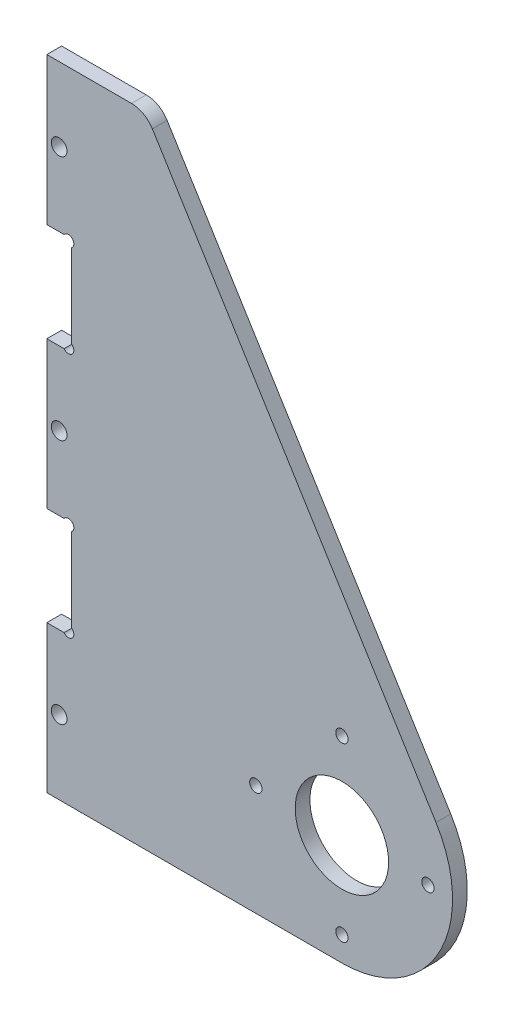
ISO-10303-21;
HEADER;
FILE_DESCRIPTION(('STEP AP214'),'2;1');
FILE_NAME('part.step','',(''),(''),'','','');
FILE_SCHEMA(('AUTOMOTIVE_DESIGN { 1 0 10303 214 1 1 1 1 }'));
ENDSEC;
DATA;
#1=APPLICATION_CONTEXT('core data for automotive mechanical design processes');
#2=APPLICATION_PROTOCOL_DEFINITION('international standard','automotive_design',2000,#1);
#3=PRODUCT_CONTEXT('',#1,'mechanical');
#4=PRODUCT('Part','Part','',(#3));
#5=PRODUCT_RELATED_PRODUCT_CATEGORY('part','',(#4));
#6=PRODUCT_DEFINITION_FORMATION('','',#4);
#7=PRODUCT_DEFINITION_CONTEXT('part definition',#1,'design');
#8=PRODUCT_DEFINITION('design','',#6,#7);
#9=PRODUCT_DEFINITION_SHAPE('','',#8);
#10=(LENGTH_UNIT() NAMED_UNIT(*) SI_UNIT(.MILLI.,.METRE.));
#11=(NAMED_UNIT(*) PLANE_ANGLE_UNIT() SI_UNIT($,.RADIAN.));
#12=(NAMED_UNIT(*) SI_UNIT($,.STERADIAN.) SOLID_ANGLE_UNIT());
#13=UNCERTAINTY_MEASURE_WITH_UNIT(LENGTH_MEASURE(1.E-05),#10,'distance_accuracy_value','');
#14=(GEOMETRIC_REPRESENTATION_CONTEXT(3) GLOBAL_UNCERTAINTY_ASSIGNED_CONTEXT((#13)) GLOBAL_UNIT_ASSIGNED_CONTEXT((#10,
#11,#12)) REPRESENTATION_CONTEXT('',''));
#15=CARTESIAN_POINT('',(0.,0.,0.));
#16=DIRECTION('',(0.,0.,1.));
#17=DIRECTION('',(1.,0.,0.));
#18=AXIS2_PLACEMENT_3D('',#15,#16,#17);
#19=CARTESIAN_POINT('',(-60.,107.5,3.));
#20=DIRECTION('',(1.,0.,0.));
#21=DIRECTION('',(0.,1.,0.));
#22=AXIS2_PLACEMENT_3D('',#19,#20,#21);
#23=PLANE('',#22);
#24=DIRECTION('',(0.,0.,-1.));
#25=VECTOR('',#24,1.);
#26=CARTESIAN_POINT('',(-60.,27.55,3.));
#27=LINE('',#26,#25);
#28=CARTESIAN_POINT('',(-60.,27.55,3.));
#29=VERTEX_POINT('',#28);
#30=CARTESIAN_POINT('',(-60.,27.55,0.));
#31=VERTEX_POINT('',#30);
#32=EDGE_CURVE('E395',#29,#31,#27,.T.);
#33=ORIENTED_EDGE('',*,*,#32,.F.);
#34=DIRECTION('',(0.,-1.,0.));
#35=VECTOR('',#34,1.);
#36=CARTESIAN_POINT('',(-60.,107.5,3.));
#37=LINE('',#36,#35);
#38=CARTESIAN_POINT('',(-60.,57.45,3.));
#39=VERTEX_POINT('',#38);
#40=EDGE_CURVE('E350',#39,#29,#37,.T.);
#41=ORIENTED_EDGE('',*,*,#40,.F.);
#42=DIRECTION('',(0.,0.,-1.));
#43=VECTOR('',#42,1.);
#44=CARTESIAN_POINT('',(-60.,57.45,3.));
#45=LINE('',#44,#43);
#46=CARTESIAN_POINT('',(-60.,57.45,0.));
#47=VERTEX_POINT('',#46);
#48=EDGE_CURVE('E392',#39,#47,#45,.T.);
#49=ORIENTED_EDGE('',*,*,#48,.T.);
#50=DIRECTION('',(0.,-1.,0.));
#51=VECTOR('',#50,1.);
#52=CARTESIAN_POINT('',(-60.,107.5,0.));
#53=LINE('',#52,#51);
#54=EDGE_CURVE('E364',#47,#31,#53,.T.);
#55=ORIENTED_EDGE('',*,*,#54,.T.);
#56=EDGE_LOOP('',(#33,#41,#49,#55));
#57=FACE_BOUND('',#56,.T.);
#58=ADVANCED_FACE('F111',(#57),#23,.F.);
#59=DIRECTION('',(0.,0.,-1.));
#60=VECTOR('',#59,1.);
#61=CARTESIAN_POINT('',(-60.,77.55,3.));
#62=LINE('',#61,#60);
#63=CARTESIAN_POINT('',(-60.,77.55,3.));
#64=VERTEX_POINT('',#63);
#65=CARTESIAN_POINT('',(-60.,77.55,0.));
#66=VERTEX_POINT('',#65);
#67=EDGE_CURVE('E390',#64,#66,#62,.T.);
#68=ORIENTED_EDGE('',*,*,#67,.F.);
#69=CARTESIAN_POINT('',(-60.,107.5,3.));
#70=VERTEX_POINT('',#69);
#71=EDGE_CURVE('E346',#70,#64,#37,.T.);
#72=ORIENTED_EDGE('',*,*,#71,.F.);
#73=DIRECTION('',(0.,0.,-1.));
#74=VECTOR('',#73,1.);
#75=CARTESIAN_POINT('',(-60.,107.5,3.));
#76=LINE('',#75,#74);
#77=CARTESIAN_POINT('',(-60.,107.5,0.));
#78=VERTEX_POINT('',#77);
#79=EDGE_CURVE('E378',#70,#78,#76,.T.);
#80=ORIENTED_EDGE('',*,*,#79,.T.);
#81=EDGE_CURVE('E360',#78,#66,#53,.T.);
#82=ORIENTED_EDGE('',*,*,#81,.T.);
#83=EDGE_LOOP('',(#68,#72,#80,#82));
#84=FACE_BOUND('',#83,.T.);
#85=ADVANCED_FACE('F454',(#84),#23,.F.);
#86=CARTESIAN_POINT('',(0.,0.,3.));
#87=DIRECTION('',(0.,0.,1.));
#88=DIRECTION('',(1.,0.,0.));
#89=AXIS2_PLACEMENT_3D('',#86,#87,#88);
#90=PLANE('',#89);
#91=CARTESIAN_POINT('',(-57.5000000000003,92.5,3.));
#92=DIRECTION('',(0.,0.,1.));
#93=DIRECTION('',(1.,0.,0.));
#94=AXIS2_PLACEMENT_3D('',#91,#92,#93);
#95=CIRCLE('',#94,1.6);
#96=CARTESIAN_POINT('',(-55.9000000000003,92.5,3.));
#97=VERTEX_POINT('',#96);
#98=EDGE_CURVE('E261',#97,#97,#95,.T.);
#99=ORIENTED_EDGE('',*,*,#98,.F.);
#100=EDGE_LOOP('',(#99));
#101=FACE_BOUND('',#100,.T.);
#102=DIRECTION('',(1.,0.,0.));
#103=VECTOR('',#102,1.);
#104=CARTESIAN_POINT('',(-60.,7.45,3.));
#105=LINE('',#104,#103);
#106=CARTESIAN_POINT('',(-60.,7.45,3.));
#107=VERTEX_POINT('',#106);
#108=CARTESIAN_POINT('',(-56.49,7.45,3.));
#109=VERTEX_POINT('',#108);
#110=EDGE_CURVE('E249',#107,#109,#105,.T.);
#111=ORIENTED_EDGE('',*,*,#110,.F.);
#112=CARTESIAN_POINT('',(-60.,-22.5,3.));
#113=VERTEX_POINT('',#112);
#114=EDGE_CURVE('E344',#107,#113,#37,.T.);
#115=ORIENTED_EDGE('',*,*,#114,.T.);
#116=DIRECTION('',(1.,0.,0.));
#117=VECTOR('',#116,1.);
#118=CARTESIAN_POINT('',(-60.,-22.5,3.));
#119=LINE('',#118,#117);
#120=CARTESIAN_POINT('',(0.,-22.5,3.));
#121=VERTEX_POINT('',#120);
#122=EDGE_CURVE('E349',#113,#121,#119,.T.);
#123=ORIENTED_EDGE('',*,*,#122,.T.);
#124=CARTESIAN_POINT('',(0.,0.,3.));
#125=DIRECTION('',(0.,0.,1.));
#126=DIRECTION('',(1.,0.,0.));
#127=AXIS2_PLACEMENT_3D('',#124,#125,#126);
#128=CIRCLE('',#127,22.5);
#129=CARTESIAN_POINT('',(19.1385979441861,11.8306410955111,3.));
#130=VERTEX_POINT('',#129);
#131=EDGE_CURVE('E352',#121,#130,#128,.T.);
#132=ORIENTED_EDGE('',*,*,#131,.T.);
#133=DIRECTION('',(-0.525806270911604,0.850604353074937,0.));
#134=VECTOR('',#133,1.);
#135=CARTESIAN_POINT('',(-40.,107.5,3.));
#136=LINE('',#135,#134);
#137=CARTESIAN_POINT('',(-38.5343712650876,105.129031354558,3.));
#138=VERTEX_POINT('',#137);
#139=EDGE_CURVE('E354',#130,#138,#136,.T.);
#140=ORIENTED_EDGE('',*,*,#139,.T.);
#141=CARTESIAN_POINT('',(-42.7873930304623,102.5,3.));
#142=DIRECTION('',(0.,0.,1.));
#143=DIRECTION('',(1.,0.,0.));
#144=AXIS2_PLACEMENT_3D('',#141,#142,#143);
#145=CIRCLE('',#144,5.);
#146=CARTESIAN_POINT('',(-42.7873930304623,107.5,3.));
#147=VERTEX_POINT('',#146);
#148=EDGE_CURVE('E388',#138,#147,#145,.T.);
#149=ORIENTED_EDGE('',*,*,#148,.T.);
#150=DIRECTION('',(-1.,0.,0.));
#151=VECTOR('',#150,1.);
#152=CARTESIAN_POINT('',(-60.,107.5,3.));
#153=LINE('',#152,#151);
#154=EDGE_CURVE('E342',#147,#70,#153,.T.);
#155=ORIENTED_EDGE('',*,*,#154,.T.);
#156=ORIENTED_EDGE('',*,*,#71,.T.);
#157=DIRECTION('',(1.,0.,0.));
#158=VECTOR('',#157,1.);
#159=CARTESIAN_POINT('',(0.,77.55,3.));
#160=LINE('',#159,#158);
#161=CARTESIAN_POINT('',(-56.4900000000002,77.55,3.));
#162=VERTEX_POINT('',#161);
#163=EDGE_CURVE('E135',#64,#162,#160,.T.);
#164=ORIENTED_EDGE('',*,*,#163,.T.);
#165=CARTESIAN_POINT('',(-55.6100000000002,76.89,3.));
#166=DIRECTION('',(0.,0.,1.));
#167=DIRECTION('',(1.,0.,0.));
#168=AXIS2_PLACEMENT_3D('',#165,#166,#167);
#169=CIRCLE('',#168,1.10000000000001);
#170=CARTESIAN_POINT('',(-54.95,76.0100000000001,3.));
#171=VERTEX_POINT('',#170);
#172=EDGE_CURVE('E284',#171,#162,#169,.T.);
#173=ORIENTED_EDGE('',*,*,#172,.F.);
#174=DIRECTION('',(0.,-1.,0.));
#175=VECTOR('',#174,1.);
#176=CARTESIAN_POINT('',(-54.95,0.,3.));
#177=LINE('',#176,#175);
#178=CARTESIAN_POINT('',(-54.95,58.99,3.));
#179=VERTEX_POINT('',#178);
#180=EDGE_CURVE('E289',#171,#179,#177,.T.);
#181=ORIENTED_EDGE('',*,*,#180,.T.);
#182=CARTESIAN_POINT('',(-55.61,58.11,3.));
#183=DIRECTION('',(0.,0.,1.));
#184=DIRECTION('',(1.,0.,0.));
#185=AXIS2_PLACEMENT_3D('',#182,#183,#184);
#186=CIRCLE('',#185,1.10000000000001);
#187=CARTESIAN_POINT('',(-56.49,57.45,3.));
#188=VERTEX_POINT('',#187);
#189=EDGE_CURVE('E281',#188,#179,#186,.T.);
#190=ORIENTED_EDGE('',*,*,#189,.F.);
#191=DIRECTION('',(1.,0.,0.));
#192=VECTOR('',#191,1.);
#193=CARTESIAN_POINT('',(0.,57.45,3.));
#194=LINE('',#193,#192);
#195=EDGE_CURVE('E298',#39,#188,#194,.T.);
#196=ORIENTED_EDGE('',*,*,#195,.F.);
#197=ORIENTED_EDGE('',*,*,#40,.T.);
#198=DIRECTION('',(1.,0.,0.));
#199=VECTOR('',#198,1.);
#200=CARTESIAN_POINT('',(-60.,27.55,3.));
#201=LINE('',#200,#199);
#202=CARTESIAN_POINT('',(-56.49,27.55,3.));
#203=VERTEX_POINT('',#202);
#204=EDGE_CURVE('E127',#29,#203,#201,.T.);
#205=ORIENTED_EDGE('',*,*,#204,.T.);
#206=CARTESIAN_POINT('',(-55.61,26.89,3.));
#207=DIRECTION('',(0.,0.,1.));
#208=DIRECTION('',(1.,0.,0.));
#209=AXIS2_PLACEMENT_3D('',#206,#207,#208);
#210=CIRCLE('',#209,1.1);
#211=CARTESIAN_POINT('',(-54.95,26.01,3.));
#212=VERTEX_POINT('',#211);
#213=EDGE_CURVE('E270',#212,#203,#210,.T.);
#214=ORIENTED_EDGE('',*,*,#213,.F.);
#215=DIRECTION('',(0.,-1.,0.));
#216=VECTOR('',#215,1.);
#217=CARTESIAN_POINT('',(-54.95,27.55,3.));
#218=LINE('',#217,#216);
#219=CARTESIAN_POINT('',(-54.95,8.99,3.));
#220=VERTEX_POINT('',#219);
#221=EDGE_CURVE('E255',#212,#220,#218,.T.);
#222=ORIENTED_EDGE('',*,*,#221,.T.);
#223=CARTESIAN_POINT('',(-55.61,8.11,3.));
#224=DIRECTION('',(0.,0.,1.));
#225=DIRECTION('',(1.,0.,0.));
#226=AXIS2_PLACEMENT_3D('',#223,#224,#225);
#227=CIRCLE('',#226,1.1);
#228=EDGE_CURVE('E242',#109,#220,#227,.T.);
#229=ORIENTED_EDGE('',*,*,#228,.F.);
#230=EDGE_LOOP('',(#111,#115,#123,#132,#140,#149,#155,#156,#164,#173,#181,#190,#196,#197,#205,
#214,#222,#229));
#231=FACE_BOUND('',#230,.T.);
#232=CARTESIAN_POINT('',(-57.5,-7.50000000000001,3.));
#233=DIRECTION('',(0.,0.,1.));
#234=DIRECTION('',(1.,0.,0.));
#235=AXIS2_PLACEMENT_3D('',#232,#233,#234);
#236=CIRCLE('',#235,1.6);
#237=CARTESIAN_POINT('',(-55.9,-7.50000000000001,3.));
#238=VERTEX_POINT('',#237);
#239=EDGE_CURVE('E274',#238,#238,#236,.T.);
#240=ORIENTED_EDGE('',*,*,#239,.F.);
#241=EDGE_LOOP('',(#240));
#242=FACE_BOUND('',#241,.T.);
#243=CARTESIAN_POINT('',(-57.5000000000002,42.5,3.));
#244=DIRECTION('',(0.,0.,1.));
#245=DIRECTION('',(1.,0.,0.));
#246=AXIS2_PLACEMENT_3D('',#243,#244,#245);
#247=CIRCLE('',#246,1.6);
#248=CARTESIAN_POINT('',(-55.9000000000002,42.5,3.));
#249=VERTEX_POINT('',#248);
#250=EDGE_CURVE('E278',#249,#249,#247,.T.);
#251=ORIENTED_EDGE('',*,*,#250,.F.);
#252=EDGE_LOOP('',(#251));
#253=FACE_BOUND('',#252,.T.);
#254=CARTESIAN_POINT('',(0.,-17.5,3.));
#255=DIRECTION('',(0.,0.,1.));
#256=DIRECTION('',(1.,0.,0.));
#257=AXIS2_PLACEMENT_3D('',#254,#255,#256);
#258=CIRCLE('',#257,1.25);
#259=CARTESIAN_POINT('',(1.24999999999994,-17.5,3.));
#260=VERTEX_POINT('',#259);
#261=EDGE_CURVE('E318',#260,#260,#258,.T.);
#262=ORIENTED_EDGE('',*,*,#261,.F.);
#263=EDGE_LOOP('',(#262));
#264=FACE_BOUND('',#263,.T.);
#265=CARTESIAN_POINT('',(0.,17.5,3.));
#266=DIRECTION('',(0.,0.,1.));
#267=DIRECTION('',(1.,0.,0.));
#268=AXIS2_PLACEMENT_3D('',#265,#266,#267);
#269=CIRCLE('',#268,1.25);
#270=CARTESIAN_POINT('',(1.25000000000005,17.5,3.));
#271=VERTEX_POINT('',#270);
#272=EDGE_CURVE('E330',#271,#271,#269,.T.);
#273=ORIENTED_EDGE('',*,*,#272,.F.);
#274=EDGE_LOOP('',(#273));
#275=FACE_BOUND('',#274,.T.);
#276=CARTESIAN_POINT('',(0.,0.,3.));
#277=DIRECTION('',(0.,0.,1.));
#278=DIRECTION('',(1.,0.,0.));
#279=AXIS2_PLACEMENT_3D('',#276,#277,#278);
#280=CIRCLE('',#279,9.5);
#281=CARTESIAN_POINT('',(9.5,0.,3.));
#282=VERTEX_POINT('',#281);
#283=EDGE_CURVE('E336',#282,#282,#280,.T.);
#284=ORIENTED_EDGE('',*,*,#283,.F.);
#285=EDGE_LOOP('',(#284));
#286=FACE_BOUND('',#285,.T.);
#287=CARTESIAN_POINT('',(17.5,0.,3.));
#288=DIRECTION('',(0.,0.,1.));
#289=DIRECTION('',(1.,0.,0.));
#290=AXIS2_PLACEMENT_3D('',#287,#288,#289);
#291=CIRCLE('',#290,1.25);
#292=CARTESIAN_POINT('',(18.75,0.,3.));
#293=VERTEX_POINT('',#292);
#294=EDGE_CURVE('E324',#293,#293,#291,.T.);
#295=ORIENTED_EDGE('',*,*,#294,.F.);
#296=EDGE_LOOP('',(#295));
#297=FACE_BOUND('',#296,.T.);
#298=CARTESIAN_POINT('',(-17.5,0.,3.));
#299=DIRECTION('',(0.,0.,1.));
#300=DIRECTION('',(1.,0.,0.));
#301=AXIS2_PLACEMENT_3D('',#298,#299,#300);
#302=CIRCLE('',#301,1.25);
#303=CARTESIAN_POINT('',(-16.25,0.,3.));
#304=VERTEX_POINT('',#303);
#305=EDGE_CURVE('E311',#304,#304,#302,.T.);
#306=ORIENTED_EDGE('',*,*,#305,.F.);
#307=EDGE_LOOP('',(#306));
#308=FACE_BOUND('',#307,.T.);
#309=ADVANCED_FACE('F257',(#101,#231,#242,#253,#264,#275,#286,#297,#308),#90,.T.);
#310=CARTESIAN_POINT('',(0.,0.,0.));
#311=DIRECTION('',(0.,0.,1.));
#312=DIRECTION('',(1.,0.,0.));
#313=AXIS2_PLACEMENT_3D('',#310,#311,#312);
#314=PLANE('',#313);
#315=CARTESIAN_POINT('',(-57.5000000000003,92.5,0.));
#316=DIRECTION('',(0.,0.,1.));
#317=DIRECTION('',(1.,0.,0.));
#318=AXIS2_PLACEMENT_3D('',#315,#316,#317);
#319=CIRCLE('',#318,1.6);
#320=CARTESIAN_POINT('',(-55.9000000000003,92.5,0.));
#321=VERTEX_POINT('',#320);
#322=EDGE_CURVE('E115',#321,#321,#319,.T.);
#323=ORIENTED_EDGE('',*,*,#322,.T.);
#324=EDGE_LOOP('',(#323));
#325=FACE_BOUND('',#324,.T.);
#326=CARTESIAN_POINT('',(-57.5,-7.50000000000001,0.));
#327=DIRECTION('',(0.,0.,1.));
#328=DIRECTION('',(1.,0.,0.));
#329=AXIS2_PLACEMENT_3D('',#326,#327,#328);
#330=CIRCLE('',#329,1.6);
#331=CARTESIAN_POINT('',(-55.9,-7.50000000000001,0.));
#332=VERTEX_POINT('',#331);
#333=EDGE_CURVE('E409',#332,#332,#330,.T.);
#334=ORIENTED_EDGE('',*,*,#333,.T.);
#335=EDGE_LOOP('',(#334));
#336=FACE_BOUND('',#335,.T.);
#337=CARTESIAN_POINT('',(-57.5000000000002,42.5,0.));
#338=DIRECTION('',(0.,0.,1.));
#339=DIRECTION('',(1.,0.,0.));
#340=AXIS2_PLACEMENT_3D('',#337,#338,#339);
#341=CIRCLE('',#340,1.6);
#342=CARTESIAN_POINT('',(-55.9000000000002,42.5,0.));
#343=VERTEX_POINT('',#342);
#344=EDGE_CURVE('E310',#343,#343,#341,.T.);
#345=ORIENTED_EDGE('',*,*,#344,.T.);
#346=EDGE_LOOP('',(#345));
#347=FACE_BOUND('',#346,.T.);
#348=CARTESIAN_POINT('',(-60.,7.45,0.));
#349=VERTEX_POINT('',#348);
#350=CARTESIAN_POINT('',(-60.,-22.5,0.));
#351=VERTEX_POINT('',#350);
#352=EDGE_CURVE('E359',#349,#351,#53,.T.);
#353=ORIENTED_EDGE('',*,*,#352,.F.);
#354=DIRECTION('',(1.,0.,0.));
#355=VECTOR('',#354,1.);
#356=CARTESIAN_POINT('',(0.,7.45,0.));
#357=LINE('',#356,#355);
#358=CARTESIAN_POINT('',(-56.49,7.45,0.));
#359=VERTEX_POINT('',#358);
#360=EDGE_CURVE('E308',#349,#359,#357,.T.);
#361=ORIENTED_EDGE('',*,*,#360,.T.);
#362=CARTESIAN_POINT('',(-55.61,8.11,0.));
#363=DIRECTION('',(0.,0.,1.));
#364=DIRECTION('',(1.,0.,0.));
#365=AXIS2_PLACEMENT_3D('',#362,#363,#364);
#366=CIRCLE('',#365,1.1);
#367=CARTESIAN_POINT('',(-54.95,8.99,0.));
#368=VERTEX_POINT('',#367);
#369=EDGE_CURVE('E12',#359,#368,#366,.T.);
#370=ORIENTED_EDGE('',*,*,#369,.T.);
#371=DIRECTION('',(0.,-1.,0.));
#372=VECTOR('',#371,1.);
#373=CARTESIAN_POINT('',(-54.95,0.,0.));
#374=LINE('',#373,#372);
#375=CARTESIAN_POINT('',(-54.95,26.01,0.));
#376=VERTEX_POINT('',#375);
#377=EDGE_CURVE('E120',#376,#368,#374,.T.);
#378=ORIENTED_EDGE('',*,*,#377,.F.);
#379=CARTESIAN_POINT('',(-55.61,26.89,0.));
#380=DIRECTION('',(0.,0.,1.));
#381=DIRECTION('',(1.,0.,0.));
#382=AXIS2_PLACEMENT_3D('',#379,#380,#381);
#383=CIRCLE('',#382,1.1);
#384=CARTESIAN_POINT('',(-56.49,27.55,0.));
#385=VERTEX_POINT('',#384);
#386=EDGE_CURVE('E406',#376,#385,#383,.T.);
#387=ORIENTED_EDGE('',*,*,#386,.T.);
#388=DIRECTION('',(1.,0.,0.));
#389=VECTOR('',#388,1.);
#390=CARTESIAN_POINT('',(0.,27.55,0.));
#391=LINE('',#390,#389);
#392=EDGE_CURVE('E306',#31,#385,#391,.T.);
#393=ORIENTED_EDGE('',*,*,#392,.F.);
#394=ORIENTED_EDGE('',*,*,#54,.F.);
#395=DIRECTION('',(1.,0.,0.));
#396=VECTOR('',#395,1.);
#397=CARTESIAN_POINT('',(0.,57.45,0.));
#398=LINE('',#397,#396);
#399=CARTESIAN_POINT('',(-56.49,57.45,0.));
#400=VERTEX_POINT('',#399);
#401=EDGE_CURVE('E303',#47,#400,#398,.T.);
#402=ORIENTED_EDGE('',*,*,#401,.T.);
#403=CARTESIAN_POINT('',(-55.61,58.11,0.));
#404=DIRECTION('',(0.,0.,1.));
#405=DIRECTION('',(1.,0.,0.));
#406=AXIS2_PLACEMENT_3D('',#403,#404,#405);
#407=CIRCLE('',#406,1.10000000000001);
#408=CARTESIAN_POINT('',(-54.95,58.99,0.));
#409=VERTEX_POINT('',#408);
#410=EDGE_CURVE('E403',#400,#409,#407,.T.);
#411=ORIENTED_EDGE('',*,*,#410,.T.);
#412=DIRECTION('',(0.,-1.,0.));
#413=VECTOR('',#412,1.);
#414=CARTESIAN_POINT('',(-54.95,0.,0.));
#415=LINE('',#414,#413);
#416=CARTESIAN_POINT('',(-54.95,76.0100000000001,0.));
#417=VERTEX_POINT('',#416);
#418=EDGE_CURVE('E401',#417,#409,#415,.T.);
#419=ORIENTED_EDGE('',*,*,#418,.F.);
#420=CARTESIAN_POINT('',(-55.6100000000002,76.89,0.));
#421=DIRECTION('',(0.,0.,1.));
#422=DIRECTION('',(1.,0.,0.));
#423=AXIS2_PLACEMENT_3D('',#420,#421,#422);
#424=CIRCLE('',#423,1.10000000000001);
#425=CARTESIAN_POINT('',(-56.4900000000002,77.55,0.));
#426=VERTEX_POINT('',#425);
#427=EDGE_CURVE('E398',#417,#426,#424,.T.);
#428=ORIENTED_EDGE('',*,*,#427,.T.);
#429=DIRECTION('',(1.,0.,0.));
#430=VECTOR('',#429,1.);
#431=CARTESIAN_POINT('',(0.,77.55,0.));
#432=LINE('',#431,#430);
#433=EDGE_CURVE('E264',#66,#426,#432,.T.);
#434=ORIENTED_EDGE('',*,*,#433,.F.);
#435=ORIENTED_EDGE('',*,*,#81,.F.);
#436=DIRECTION('',(-1.,0.,0.));
#437=VECTOR('',#436,1.);
#438=CARTESIAN_POINT('',(-60.,107.5,0.));
#439=LINE('',#438,#437);
#440=CARTESIAN_POINT('',(-42.7873930304623,107.5,0.));
#441=VERTEX_POINT('',#440);
#442=EDGE_CURVE('E339',#441,#78,#439,.T.);
#443=ORIENTED_EDGE('',*,*,#442,.F.);
#444=CARTESIAN_POINT('',(-42.7873930304623,102.5,0.));
#445=DIRECTION('',(0.,0.,1.));
#446=DIRECTION('',(1.,0.,0.));
#447=AXIS2_PLACEMENT_3D('',#444,#445,#446);
#448=CIRCLE('',#447,5.);
#449=CARTESIAN_POINT('',(-38.5343712650876,105.129031354558,0.));
#450=VERTEX_POINT('',#449);
#451=EDGE_CURVE('E384',#441,#450,#448,.F.);
#452=ORIENTED_EDGE('',*,*,#451,.T.);
#453=DIRECTION('',(-0.525806270911604,0.850604353074937,0.));
#454=VECTOR('',#453,1.);
#455=CARTESIAN_POINT('',(-40.,107.5,0.));
#456=LINE('',#455,#454);
#457=CARTESIAN_POINT('',(19.1385979441861,11.8306410955111,0.));
#458=VERTEX_POINT('',#457);
#459=EDGE_CURVE('E345',#458,#450,#456,.T.);
#460=ORIENTED_EDGE('',*,*,#459,.F.);
#461=CARTESIAN_POINT('',(0.,0.,0.));
#462=DIRECTION('',(0.,0.,1.));
#463=DIRECTION('',(1.,0.,0.));
#464=AXIS2_PLACEMENT_3D('',#461,#462,#463);
#465=CIRCLE('',#464,22.5);
#466=CARTESIAN_POINT('',(0.,-22.5,0.));
#467=VERTEX_POINT('',#466);
#468=EDGE_CURVE('E366',#467,#458,#465,.T.);
#469=ORIENTED_EDGE('',*,*,#468,.F.);
#470=DIRECTION('',(1.,0.,0.));
#471=VECTOR('',#470,1.);
#472=CARTESIAN_POINT('',(-40.,-22.5,0.));
#473=LINE('',#472,#471);
#474=EDGE_CURVE('E363',#351,#467,#473,.T.);
#475=ORIENTED_EDGE('',*,*,#474,.F.);
#476=EDGE_LOOP('',(#353,#361,#370,#378,#387,#393,#394,#402,#411,#419,#428,#434,#435,#443,#452,
#460,#469,#475));
#477=FACE_BOUND('',#476,.T.);
#478=CARTESIAN_POINT('',(0.,0.,0.));
#479=DIRECTION('',(0.,0.,1.));
#480=DIRECTION('',(1.,0.,0.));
#481=AXIS2_PLACEMENT_3D('',#478,#479,#480);
#482=CIRCLE('',#481,9.5);
#483=CARTESIAN_POINT('',(9.5,0.,0.));
#484=VERTEX_POINT('',#483);
#485=EDGE_CURVE('E333',#484,#484,#482,.T.);
#486=ORIENTED_EDGE('',*,*,#485,.T.);
#487=EDGE_LOOP('',(#486));
#488=FACE_BOUND('',#487,.T.);
#489=CARTESIAN_POINT('',(0.,17.5,0.));
#490=DIRECTION('',(0.,0.,1.));
#491=DIRECTION('',(1.,0.,0.));
#492=AXIS2_PLACEMENT_3D('',#489,#490,#491);
#493=CIRCLE('',#492,1.25);
#494=CARTESIAN_POINT('',(1.25000000000005,17.5,0.));
#495=VERTEX_POINT('',#494);
#496=EDGE_CURVE('E327',#495,#495,#493,.T.);
#497=ORIENTED_EDGE('',*,*,#496,.T.);
#498=EDGE_LOOP('',(#497));
#499=FACE_BOUND('',#498,.T.);
#500=CARTESIAN_POINT('',(17.5,0.,0.));
#501=DIRECTION('',(0.,0.,1.));
#502=DIRECTION('',(1.,0.,0.));
#503=AXIS2_PLACEMENT_3D('',#500,#501,#502);
#504=CIRCLE('',#503,1.25);
#505=CARTESIAN_POINT('',(18.75,0.,0.));
#506=VERTEX_POINT('',#505);
#507=EDGE_CURVE('E321',#506,#506,#504,.T.);
#508=ORIENTED_EDGE('',*,*,#507,.T.);
#509=EDGE_LOOP('',(#508));
#510=FACE_BOUND('',#509,.T.);
#511=CARTESIAN_POINT('',(0.,-17.5,0.));
#512=DIRECTION('',(0.,0.,1.));
#513=DIRECTION('',(1.,0.,0.));
#514=AXIS2_PLACEMENT_3D('',#511,#512,#513);
#515=CIRCLE('',#514,1.25);
#516=CARTESIAN_POINT('',(1.24999999999994,-17.5,0.));
#517=VERTEX_POINT('',#516);
#518=EDGE_CURVE('E314',#517,#517,#515,.T.);
#519=ORIENTED_EDGE('',*,*,#518,.T.);
#520=EDGE_LOOP('',(#519));
#521=FACE_BOUND('',#520,.T.);
#522=CARTESIAN_POINT('',(-17.5,0.,0.));
#523=DIRECTION('',(0.,0.,1.));
#524=DIRECTION('',(1.,0.,0.));
#525=AXIS2_PLACEMENT_3D('',#522,#523,#524);
#526=CIRCLE('',#525,1.25);
#527=CARTESIAN_POINT('',(-16.25,0.,0.));
#528=VERTEX_POINT('',#527);
#529=EDGE_CURVE('E315',#528,#528,#526,.T.);
#530=ORIENTED_EDGE('',*,*,#529,.T.);
#531=EDGE_LOOP('',(#530));
#532=FACE_BOUND('',#531,.T.);
#533=ADVANCED_FACE('F420',(#325,#336,#347,#477,#488,#499,#510,#521,#532),#314,.F.);
#534=CARTESIAN_POINT('',(-60.,107.5,3.));
#535=DIRECTION('',(0.,-1.,0.));
#536=DIRECTION('',(0.,0.,-1.));
#537=AXIS2_PLACEMENT_3D('',#534,#535,#536);
#538=PLANE('',#537);
#539=ORIENTED_EDGE('',*,*,#154,.F.);
#540=DIRECTION('',(0.,0.,-1.));
#541=VECTOR('',#540,1.);
#542=CARTESIAN_POINT('',(-42.7873930304623,107.5,3.));
#543=LINE('',#542,#541);
#544=EDGE_CURVE('E381',#147,#441,#543,.T.);
#545=ORIENTED_EDGE('',*,*,#544,.T.);
#546=ORIENTED_EDGE('',*,*,#442,.T.);
#547=ORIENTED_EDGE('',*,*,#79,.F.);
#548=EDGE_LOOP('',(#539,#545,#546,#547));
#549=FACE_BOUND('',#548,.T.);
#550=ADVANCED_FACE('F464',(#549),#538,.F.);
#551=ORIENTED_EDGE('',*,*,#114,.F.);
#552=DIRECTION('',(0.,0.,-1.));
#553=VECTOR('',#552,1.);
#554=CARTESIAN_POINT('',(-60.,7.45,3.));
#555=LINE('',#554,#553);
#556=EDGE_CURVE('E252',#107,#349,#555,.T.);
#557=ORIENTED_EDGE('',*,*,#556,.T.);
#558=ORIENTED_EDGE('',*,*,#352,.T.);
#559=DIRECTION('',(0.,0.,-1.));
#560=VECTOR('',#559,1.);
#561=CARTESIAN_POINT('',(-60.,-22.5,3.));
#562=LINE('',#561,#560);
#563=EDGE_CURVE('E375',#113,#351,#562,.T.);
#564=ORIENTED_EDGE('',*,*,#563,.F.);
#565=EDGE_LOOP('',(#551,#557,#558,#564));
#566=FACE_BOUND('',#565,.T.);
#567=ADVANCED_FACE('F424',(#566),#23,.F.);
#568=CARTESIAN_POINT('',(-40.,-22.5,3.));
#569=DIRECTION('',(0.,1.,0.));
#570=DIRECTION('',(-1.,0.,0.));
#571=AXIS2_PLACEMENT_3D('',#568,#569,#570);
#572=PLANE('',#571);
#573=ORIENTED_EDGE('',*,*,#474,.T.);
#574=DIRECTION('',(0.,0.,-1.));
#575=VECTOR('',#574,1.);
#576=CARTESIAN_POINT('',(0.,-22.5,3.));
#577=LINE('',#576,#575);
#578=EDGE_CURVE('E372',#121,#467,#577,.T.);
#579=ORIENTED_EDGE('',*,*,#578,.F.);
#580=ORIENTED_EDGE('',*,*,#122,.F.);
#581=ORIENTED_EDGE('',*,*,#563,.T.);
#582=EDGE_LOOP('',(#573,#579,#580,#581));
#583=FACE_BOUND('',#582,.T.);
#584=ADVANCED_FACE('F463',(#583),#572,.F.);
#585=CARTESIAN_POINT('',(0.,0.,3.));
#586=DIRECTION('',(0.,0.,-1.));
#587=DIRECTION('',(-1.,0.,0.));
#588=AXIS2_PLACEMENT_3D('',#585,#586,#587);
#589=CYLINDRICAL_SURFACE('',#588,22.5);
#590=ORIENTED_EDGE('',*,*,#468,.T.);
#591=DIRECTION('',(0.,0.,-1.));
#592=VECTOR('',#591,1.);
#593=CARTESIAN_POINT('',(19.1385979441861,11.8306410955111,3.));
#594=LINE('',#593,#592);
#595=EDGE_CURVE('E357',#130,#458,#594,.T.);
#596=ORIENTED_EDGE('',*,*,#595,.F.);
#597=ORIENTED_EDGE('',*,*,#131,.F.);
#598=ORIENTED_EDGE('',*,*,#578,.T.);
#599=EDGE_LOOP('',(#590,#596,#597,#598));
#600=FACE_BOUND('',#599,.T.);
#601=ADVANCED_FACE('F470',(#600),#589,.T.);
#602=CARTESIAN_POINT('',(-40.,107.5,3.));
#603=DIRECTION('',(-0.850604353074937,-0.525806270911604,0.));
#604=DIRECTION('',(0.525806270911604,-0.850604353074937,0.));
#605=AXIS2_PLACEMENT_3D('',#602,#603,#604);
#606=PLANE('',#605);
#607=ORIENTED_EDGE('',*,*,#459,.T.);
#608=DIRECTION('',(0.,0.,-1.));
#609=VECTOR('',#608,1.);
#610=CARTESIAN_POINT('',(-38.5343712650876,105.129031354558,3.));
#611=LINE('',#610,#609);
#612=EDGE_CURVE('E386',#450,#138,#611,.F.);
#613=ORIENTED_EDGE('',*,*,#612,.T.);
#614=ORIENTED_EDGE('',*,*,#139,.F.);
#615=ORIENTED_EDGE('',*,*,#595,.T.);
#616=EDGE_LOOP('',(#607,#613,#614,#615));
#617=FACE_BOUND('',#616,.T.);
#618=ADVANCED_FACE('F492',(#617),#606,.F.);
#619=CARTESIAN_POINT('',(0.,0.,3.));
#620=DIRECTION('',(0.,0.,-1.));
#621=DIRECTION('',(-1.,0.,0.));
#622=AXIS2_PLACEMENT_3D('',#619,#620,#621);
#623=CYLINDRICAL_SURFACE('',#622,9.5);
#624=ORIENTED_EDGE('',*,*,#283,.T.);
#625=EDGE_LOOP('',(#624));
#626=FACE_BOUND('',#625,.T.);
#627=ORIENTED_EDGE('',*,*,#485,.F.);
#628=EDGE_LOOP('',(#627));
#629=FACE_BOUND('',#628,.T.);
#630=ADVANCED_FACE('F503',(#626,#629),#623,.F.);
#631=CARTESIAN_POINT('',(0.,17.5,3.));
#632=DIRECTION('',(0.,0.,-1.));
#633=DIRECTION('',(-1.,0.,0.));
#634=AXIS2_PLACEMENT_3D('',#631,#632,#633);
#635=CYLINDRICAL_SURFACE('',#634,1.25);
#636=ORIENTED_EDGE('',*,*,#272,.T.);
#637=EDGE_LOOP('',(#636));
#638=FACE_BOUND('',#637,.T.);
#639=ORIENTED_EDGE('',*,*,#496,.F.);
#640=EDGE_LOOP('',(#639));
#641=FACE_BOUND('',#640,.T.);
#642=ADVANCED_FACE('F510',(#638,#641),#635,.F.);
#643=CARTESIAN_POINT('',(17.5,0.,3.));
#644=DIRECTION('',(0.,0.,-1.));
#645=DIRECTION('',(-1.,0.,0.));
#646=AXIS2_PLACEMENT_3D('',#643,#644,#645);
#647=CYLINDRICAL_SURFACE('',#646,1.25);
#648=ORIENTED_EDGE('',*,*,#294,.T.);
#649=EDGE_LOOP('',(#648));
#650=FACE_BOUND('',#649,.T.);
#651=ORIENTED_EDGE('',*,*,#507,.F.);
#652=EDGE_LOOP('',(#651));
#653=FACE_BOUND('',#652,.T.);
#654=ADVANCED_FACE('F514',(#650,#653),#647,.F.);
#655=CARTESIAN_POINT('',(0.,-17.5,3.));
#656=DIRECTION('',(0.,0.,-1.));
#657=DIRECTION('',(-1.,0.,0.));
#658=AXIS2_PLACEMENT_3D('',#655,#656,#657);
#659=CYLINDRICAL_SURFACE('',#658,1.25);
#660=ORIENTED_EDGE('',*,*,#261,.T.);
#661=EDGE_LOOP('',(#660));
#662=FACE_BOUND('',#661,.T.);
#663=ORIENTED_EDGE('',*,*,#518,.F.);
#664=EDGE_LOOP('',(#663));
#665=FACE_BOUND('',#664,.T.);
#666=ADVANCED_FACE('F518',(#662,#665),#659,.F.);
#667=CARTESIAN_POINT('',(-17.5,0.,3.));
#668=DIRECTION('',(0.,0.,-1.));
#669=DIRECTION('',(-1.,0.,0.));
#670=AXIS2_PLACEMENT_3D('',#667,#668,#669);
#671=CYLINDRICAL_SURFACE('',#670,1.25);
#672=ORIENTED_EDGE('',*,*,#305,.T.);
#673=EDGE_LOOP('',(#672));
#674=FACE_BOUND('',#673,.T.);
#675=ORIENTED_EDGE('',*,*,#529,.F.);
#676=EDGE_LOOP('',(#675));
#677=FACE_BOUND('',#676,.T.);
#678=ADVANCED_FACE('F522',(#674,#677),#671,.F.);
#679=CARTESIAN_POINT('',(-42.7873930304623,102.5,3.));
#680=DIRECTION('',(0.,0.,-1.));
#681=DIRECTION('',(-1.,0.,0.));
#682=AXIS2_PLACEMENT_3D('',#679,#680,#681);
#683=CYLINDRICAL_SURFACE('',#682,5.);
#684=ORIENTED_EDGE('',*,*,#148,.F.);
#685=ORIENTED_EDGE('',*,*,#612,.F.);
#686=ORIENTED_EDGE('',*,*,#451,.F.);
#687=ORIENTED_EDGE('',*,*,#544,.F.);
#688=EDGE_LOOP('',(#684,#685,#686,#687));
#689=FACE_BOUND('',#688,.T.);
#690=ADVANCED_FACE('F113',(#689),#683,.T.);
#691=CARTESIAN_POINT('',(-54.95,0.,-7.));
#692=DIRECTION('',(-1.,0.,0.));
#693=DIRECTION('',(0.,0.,1.));
#694=AXIS2_PLACEMENT_3D('',#691,#692,#693);
#695=PLANE('',#694);
#696=ORIENTED_EDGE('',*,*,#418,.T.);
#697=DIRECTION('',(0.,0.,1.));
#698=VECTOR('',#697,1.);
#699=CARTESIAN_POINT('',(-54.95,58.99,-7.));
#700=LINE('',#699,#698);
#701=EDGE_CURVE('E292',#409,#179,#700,.T.);
#702=ORIENTED_EDGE('',*,*,#701,.T.);
#703=ORIENTED_EDGE('',*,*,#180,.F.);
#704=DIRECTION('',(0.,0.,1.));
#705=VECTOR('',#704,1.);
#706=CARTESIAN_POINT('',(-54.95,76.0100000000001,-7.));
#707=LINE('',#706,#705);
#708=EDGE_CURVE('E294',#417,#171,#707,.T.);
#709=ORIENTED_EDGE('',*,*,#708,.F.);
#710=EDGE_LOOP('',(#696,#702,#703,#709));
#711=FACE_BOUND('',#710,.T.);
#712=ADVANCED_FACE('F526',(#711),#695,.T.);
#713=CARTESIAN_POINT('',(-55.61,58.11,-7.));
#714=DIRECTION('',(0.,0.,1.));
#715=DIRECTION('',(1.,0.,0.));
#716=AXIS2_PLACEMENT_3D('',#713,#714,#715);
#717=CYLINDRICAL_SURFACE('',#716,1.10000000000001);
#718=DIRECTION('',(0.,0.,1.));
#719=VECTOR('',#718,1.);
#720=CARTESIAN_POINT('',(-56.49,57.45,-7.));
#721=LINE('',#720,#719);
#722=EDGE_CURVE('E290',#400,#188,#721,.T.);
#723=ORIENTED_EDGE('',*,*,#722,.T.);
#724=ORIENTED_EDGE('',*,*,#189,.T.);
#725=ORIENTED_EDGE('',*,*,#701,.F.);
#726=ORIENTED_EDGE('',*,*,#410,.F.);
#727=EDGE_LOOP('',(#723,#724,#725,#726));
#728=FACE_BOUND('',#727,.T.);
#729=ADVANCED_FACE('F528',(#728),#717,.F.);
#730=CARTESIAN_POINT('',(-55.6100000000002,76.89,-7.));
#731=DIRECTION('',(0.,0.,1.));
#732=DIRECTION('',(1.,0.,0.));
#733=AXIS2_PLACEMENT_3D('',#730,#731,#732);
#734=CYLINDRICAL_SURFACE('',#733,1.10000000000001);
#735=ORIENTED_EDGE('',*,*,#708,.T.);
#736=ORIENTED_EDGE('',*,*,#172,.T.);
#737=DIRECTION('',(0.,0.,1.));
#738=VECTOR('',#737,1.);
#739=CARTESIAN_POINT('',(-56.4900000000002,77.55,-7.));
#740=LINE('',#739,#738);
#741=EDGE_CURVE('E287',#426,#162,#740,.T.);
#742=ORIENTED_EDGE('',*,*,#741,.F.);
#743=ORIENTED_EDGE('',*,*,#427,.F.);
#744=EDGE_LOOP('',(#735,#736,#742,#743));
#745=FACE_BOUND('',#744,.T.);
#746=ADVANCED_FACE('F531',(#745),#734,.F.);
#747=CARTESIAN_POINT('',(0.,57.45,-7.));
#748=DIRECTION('',(0.,-1.,0.));
#749=DIRECTION('',(0.,0.,-1.));
#750=AXIS2_PLACEMENT_3D('',#747,#748,#749);
#751=PLANE('',#750);
#752=ORIENTED_EDGE('',*,*,#48,.F.);
#753=ORIENTED_EDGE('',*,*,#195,.T.);
#754=ORIENTED_EDGE('',*,*,#722,.F.);
#755=ORIENTED_EDGE('',*,*,#401,.F.);
#756=EDGE_LOOP('',(#752,#753,#754,#755));
#757=FACE_BOUND('',#756,.T.);
#758=ADVANCED_FACE('F449',(#757),#751,.F.);
#759=CARTESIAN_POINT('',(0.,77.55,-7.));
#760=DIRECTION('',(0.,-1.,0.));
#761=DIRECTION('',(0.,0.,-1.));
#762=AXIS2_PLACEMENT_3D('',#759,#760,#761);
#763=PLANE('',#762);
#764=ORIENTED_EDGE('',*,*,#433,.T.);
#765=ORIENTED_EDGE('',*,*,#741,.T.);
#766=ORIENTED_EDGE('',*,*,#163,.F.);
#767=ORIENTED_EDGE('',*,*,#67,.T.);
#768=EDGE_LOOP('',(#764,#765,#766,#767));
#769=FACE_BOUND('',#768,.T.);
#770=ADVANCED_FACE('F442',(#769),#763,.T.);
#771=CARTESIAN_POINT('',(-55.61,26.89,-7.));
#772=DIRECTION('',(0.,0.,1.));
#773=DIRECTION('',(1.,0.,0.));
#774=AXIS2_PLACEMENT_3D('',#771,#772,#773);
#775=CYLINDRICAL_SURFACE('',#774,1.1);
#776=DIRECTION('',(0.,0.,1.));
#777=VECTOR('',#776,1.);
#778=CARTESIAN_POINT('',(-54.95,26.01,-7.));
#779=LINE('',#778,#777);
#780=EDGE_CURVE('E273',#212,#376,#779,.F.);
#781=ORIENTED_EDGE('',*,*,#780,.F.);
#782=ORIENTED_EDGE('',*,*,#213,.T.);
#783=DIRECTION('',(0.,0.,1.));
#784=VECTOR('',#783,1.);
#785=CARTESIAN_POINT('',(-56.49,27.55,-7.));
#786=LINE('',#785,#784);
#787=EDGE_CURVE('E277',#385,#203,#786,.T.);
#788=ORIENTED_EDGE('',*,*,#787,.F.);
#789=ORIENTED_EDGE('',*,*,#386,.F.);
#790=EDGE_LOOP('',(#781,#782,#788,#789));
#791=FACE_BOUND('',#790,.T.);
#792=ADVANCED_FACE('F438',(#791),#775,.F.);
#793=CARTESIAN_POINT('',(-55.61,8.11,-7.));
#794=DIRECTION('',(0.,0.,1.));
#795=DIRECTION('',(1.,0.,0.));
#796=AXIS2_PLACEMENT_3D('',#793,#794,#795);
#797=CYLINDRICAL_SURFACE('',#796,1.1);
#798=DIRECTION('',(0.,0.,1.));
#799=VECTOR('',#798,1.);
#800=CARTESIAN_POINT('',(-56.49,7.45,-7.));
#801=LINE('',#800,#799);
#802=EDGE_CURVE('E237',#109,#359,#801,.F.);
#803=ORIENTED_EDGE('',*,*,#802,.F.);
#804=ORIENTED_EDGE('',*,*,#228,.T.);
#805=DIRECTION('',(0.,0.,1.));
#806=VECTOR('',#805,1.);
#807=CARTESIAN_POINT('',(-54.95,8.99,-7.));
#808=LINE('',#807,#806);
#809=EDGE_CURVE('E246',#220,#368,#808,.F.);
#810=ORIENTED_EDGE('',*,*,#809,.T.);
#811=ORIENTED_EDGE('',*,*,#369,.F.);
#812=EDGE_LOOP('',(#803,#804,#810,#811));
#813=FACE_BOUND('',#812,.T.);
#814=ADVANCED_FACE('F239',(#813),#797,.F.);
#815=CARTESIAN_POINT('',(-54.95,27.55,-7.));
#816=DIRECTION('',(-1.,0.,0.));
#817=DIRECTION('',(0.,0.,1.));
#818=AXIS2_PLACEMENT_3D('',#815,#816,#817);
#819=PLANE('',#818);
#820=ORIENTED_EDGE('',*,*,#377,.T.);
#821=ORIENTED_EDGE('',*,*,#809,.F.);
#822=ORIENTED_EDGE('',*,*,#221,.F.);
#823=ORIENTED_EDGE('',*,*,#780,.T.);
#824=EDGE_LOOP('',(#820,#821,#822,#823));
#825=FACE_BOUND('',#824,.T.);
#826=ADVANCED_FACE('F417',(#825),#819,.T.);
#827=CARTESIAN_POINT('',(-60.,7.45,-7.));
#828=DIRECTION('',(0.,-1.,0.));
#829=DIRECTION('',(0.,0.,-1.));
#830=AXIS2_PLACEMENT_3D('',#827,#828,#829);
#831=PLANE('',#830);
#832=ORIENTED_EDGE('',*,*,#556,.F.);
#833=ORIENTED_EDGE('',*,*,#110,.T.);
#834=ORIENTED_EDGE('',*,*,#802,.T.);
#835=ORIENTED_EDGE('',*,*,#360,.F.);
#836=EDGE_LOOP('',(#832,#833,#834,#835));
#837=FACE_BOUND('',#836,.T.);
#838=ADVANCED_FACE('F250',(#837),#831,.F.);
#839=CARTESIAN_POINT('',(-60.,27.55,-7.));
#840=DIRECTION('',(0.,-1.,0.));
#841=DIRECTION('',(1.,0.,0.));
#842=AXIS2_PLACEMENT_3D('',#839,#840,#841);
#843=PLANE('',#842);
#844=ORIENTED_EDGE('',*,*,#392,.T.);
#845=ORIENTED_EDGE('',*,*,#787,.T.);
#846=ORIENTED_EDGE('',*,*,#204,.F.);
#847=ORIENTED_EDGE('',*,*,#32,.T.);
#848=EDGE_LOOP('',(#844,#845,#846,#847));
#849=FACE_BOUND('',#848,.T.);
#850=ADVANCED_FACE('F435',(#849),#843,.T.);
#851=CARTESIAN_POINT('',(-57.5000000000002,42.5,-7.));
#852=DIRECTION('',(0.,0.,1.));
#853=DIRECTION('',(1.,0.,0.));
#854=AXIS2_PLACEMENT_3D('',#851,#852,#853);
#855=CYLINDRICAL_SURFACE('',#854,1.6);
#856=ORIENTED_EDGE('',*,*,#250,.T.);
#857=EDGE_LOOP('',(#856));
#858=FACE_BOUND('',#857,.T.);
#859=ORIENTED_EDGE('',*,*,#344,.F.);
#860=EDGE_LOOP('',(#859));
#861=FACE_BOUND('',#860,.T.);
#862=ADVANCED_FACE('F540',(#858,#861),#855,.F.);
#863=CARTESIAN_POINT('',(-57.5,-7.50000000000001,-7.));
#864=DIRECTION('',(0.,0.,1.));
#865=DIRECTION('',(1.,0.,0.));
#866=AXIS2_PLACEMENT_3D('',#863,#864,#865);
#867=CYLINDRICAL_SURFACE('',#866,1.6);
#868=ORIENTED_EDGE('',*,*,#239,.T.);
#869=EDGE_LOOP('',(#868));
#870=FACE_BOUND('',#869,.T.);
#871=ORIENTED_EDGE('',*,*,#333,.F.);
#872=EDGE_LOOP('',(#871));
#873=FACE_BOUND('',#872,.T.);
#874=ADVANCED_FACE('F542',(#870,#873),#867,.F.);
#875=CARTESIAN_POINT('',(-57.5000000000003,92.5,-7.));
#876=DIRECTION('',(0.,0.,1.));
#877=DIRECTION('',(1.,0.,0.));
#878=AXIS2_PLACEMENT_3D('',#875,#876,#877);
#879=CYLINDRICAL_SURFACE('',#878,1.6);
#880=ORIENTED_EDGE('',*,*,#98,.T.);
#881=EDGE_LOOP('',(#880));
#882=FACE_BOUND('',#881,.T.);
#883=ORIENTED_EDGE('',*,*,#322,.F.);
#884=EDGE_LOOP('',(#883));
#885=FACE_BOUND('',#884,.T.);
#886=ADVANCED_FACE('F545',(#882,#885),#879,.F.);
#887=CLOSED_SHELL('',(#58,#85,#309,#533,#550,#567,#584,#601,#618,#630,#642,#654,#666,#678,#690,
#712,#729,#746,#758,#770,#792,#814,#826,#838,#850,#862,#874,#886));
#888=MANIFOLD_SOLID_BREP('B2',#887);
#889=ADVANCED_BREP_SHAPE_REPRESENTATION('',(#18,#888),#14);
#890=SHAPE_DEFINITION_REPRESENTATION(#9,#889);
ENDSEC;
END-ISO-10303-21;
